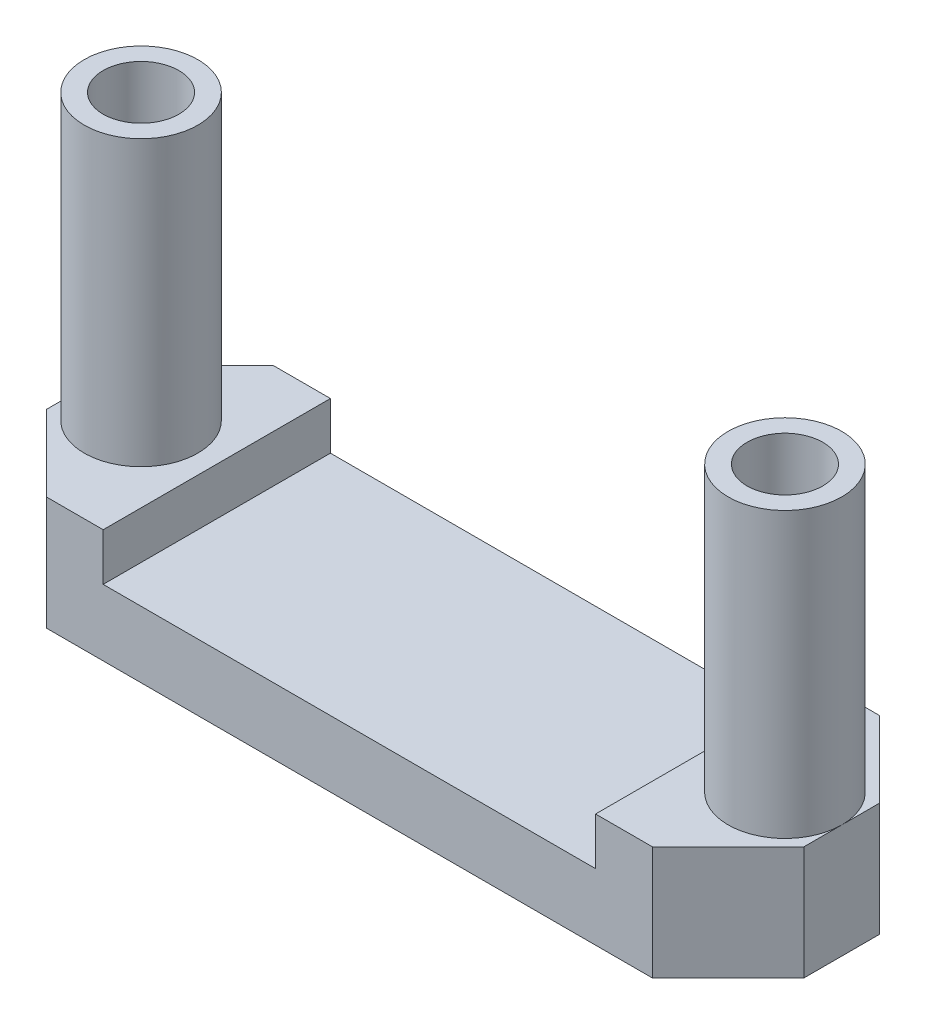
ISO-10303-21;
HEADER;
FILE_DESCRIPTION(('STEP AP214'),'2;1');
FILE_NAME('part.step','',(''),(''),'','','');
FILE_SCHEMA(('AUTOMOTIVE_DESIGN { 1 0 10303 214 1 1 1 1 }'));
ENDSEC;
DATA;
#1=APPLICATION_CONTEXT('core data for automotive mechanical design processes');
#2=APPLICATION_PROTOCOL_DEFINITION('international standard','automotive_design',2000,#1);
#3=PRODUCT_CONTEXT('',#1,'mechanical');
#4=PRODUCT('Part','Part','',(#3));
#5=PRODUCT_RELATED_PRODUCT_CATEGORY('part','',(#4));
#6=PRODUCT_DEFINITION_FORMATION('','',#4);
#7=PRODUCT_DEFINITION_CONTEXT('part definition',#1,'design');
#8=PRODUCT_DEFINITION('design','',#6,#7);
#9=PRODUCT_DEFINITION_SHAPE('','',#8);
#10=(LENGTH_UNIT() NAMED_UNIT(*) SI_UNIT(.MILLI.,.METRE.));
#11=(NAMED_UNIT(*) PLANE_ANGLE_UNIT() SI_UNIT($,.RADIAN.));
#12=(NAMED_UNIT(*) SI_UNIT($,.STERADIAN.) SOLID_ANGLE_UNIT());
#13=UNCERTAINTY_MEASURE_WITH_UNIT(LENGTH_MEASURE(1.E-05),#10,'distance_accuracy_value','');
#14=(GEOMETRIC_REPRESENTATION_CONTEXT(3) GLOBAL_UNCERTAINTY_ASSIGNED_CONTEXT((#13)) GLOBAL_UNIT_ASSIGNED_CONTEXT((#10,
#11,#12)) REPRESENTATION_CONTEXT('',''));
#15=CARTESIAN_POINT('',(0.,0.,0.));
#16=DIRECTION('',(0.,0.,1.));
#17=DIRECTION('',(1.,0.,0.));
#18=AXIS2_PLACEMENT_3D('',#15,#16,#17);
#19=CARTESIAN_POINT('',(0.,3.,0.));
#20=DIRECTION('',(0.,-1.,0.));
#21=DIRECTION('',(0.,0.,-1.));
#22=AXIS2_PLACEMENT_3D('',#19,#20,#21);
#23=PLANE('',#22);
#24=DIRECTION('',(0.,0.,1.));
#25=VECTOR('',#24,1.);
#26=CARTESIAN_POINT('',(-9.99999999999999,3.,3.));
#27=LINE('',#26,#25);
#28=CARTESIAN_POINT('',(-9.99999999999999,3.,-1.));
#29=VERTEX_POINT('',#28);
#30=CARTESIAN_POINT('',(-9.99999999999999,3.,0.));
#31=VERTEX_POINT('',#30);
#32=EDGE_CURVE('E139',#29,#31,#27,.T.);
#33=ORIENTED_EDGE('',*,*,#32,.T.);
#34=CARTESIAN_POINT('',(-8.49999999999999,3.,0.));
#35=DIRECTION('',(0.,1.,0.));
#36=DIRECTION('',(0.,0.,1.));
#37=AXIS2_PLACEMENT_3D('',#34,#35,#36);
#38=CIRCLE('',#37,1.5);
#39=EDGE_CURVE('E141',#31,#31,#38,.T.);
#40=ORIENTED_EDGE('',*,*,#39,.F.);
#41=CARTESIAN_POINT('',(-9.99999999999999,3.,0.999999999999991));
#42=VERTEX_POINT('',#41);
#43=EDGE_CURVE('E67',#31,#42,#27,.T.);
#44=ORIENTED_EDGE('',*,*,#43,.T.);
#45=DIRECTION('',(-0.707106781186546,0.,-0.707106781186549));
#46=VECTOR('',#45,1.);
#47=CARTESIAN_POINT('',(-7.99999999999999,3.,3.));
#48=LINE('',#47,#46);
#49=CARTESIAN_POINT('',(-7.99999999999999,3.,3.));
#50=VERTEX_POINT('',#49);
#51=EDGE_CURVE('E55',#42,#50,#48,.F.);
#52=ORIENTED_EDGE('',*,*,#51,.T.);
#53=DIRECTION('',(1.,0.,0.));
#54=VECTOR('',#53,1.);
#55=CARTESIAN_POINT('',(-9.99999999999999,3.,3.));
#56=LINE('',#55,#54);
#57=CARTESIAN_POINT('',(-6.5,3.,3.));
#58=VERTEX_POINT('',#57);
#59=EDGE_CURVE('E162',#50,#58,#56,.T.);
#60=ORIENTED_EDGE('',*,*,#59,.T.);
#61=DIRECTION('',(0.,0.,1.));
#62=VECTOR('',#61,1.);
#63=CARTESIAN_POINT('',(-6.5,3.,3.));
#64=LINE('',#63,#62);
#65=CARTESIAN_POINT('',(-6.5,3.,-3.));
#66=VERTEX_POINT('',#65);
#67=EDGE_CURVE('E280',#66,#58,#64,.T.);
#68=ORIENTED_EDGE('',*,*,#67,.F.);
#69=DIRECTION('',(-1.,0.,0.));
#70=VECTOR('',#69,1.);
#71=CARTESIAN_POINT('',(-9.99999999999999,3.,-3.));
#72=LINE('',#71,#70);
#73=CARTESIAN_POINT('',(-7.99999999999999,3.,-3.));
#74=VERTEX_POINT('',#73);
#75=EDGE_CURVE('E158',#66,#74,#72,.T.);
#76=ORIENTED_EDGE('',*,*,#75,.T.);
#77=DIRECTION('',(0.707106781186549,0.,-0.707106781186546));
#78=VECTOR('',#77,1.);
#79=CARTESIAN_POINT('',(-9.99999999999999,3.,-1.));
#80=LINE('',#79,#78);
#81=EDGE_CURVE('E11',#74,#29,#80,.F.);
#82=ORIENTED_EDGE('',*,*,#81,.T.);
#83=EDGE_LOOP('',(#33,#40,#44,#52,#60,#68,#76,#82));
#84=FACE_BOUND('',#83,.T.);
#85=ADVANCED_FACE('F45',(#84),#23,.F.);
#86=DIRECTION('',(0.,0.,-1.));
#87=VECTOR('',#86,1.);
#88=CARTESIAN_POINT('',(10.,3.,3.));
#89=LINE('',#88,#87);
#90=CARTESIAN_POINT('',(10.,3.,1.));
#91=VERTEX_POINT('',#90);
#92=CARTESIAN_POINT('',(10.,3.,0.));
#93=VERTEX_POINT('',#92);
#94=EDGE_CURVE('E264',#91,#93,#89,.T.);
#95=ORIENTED_EDGE('',*,*,#94,.T.);
#96=CARTESIAN_POINT('',(8.49999999999999,3.,0.));
#97=DIRECTION('',(0.,-1.,0.));
#98=DIRECTION('',(0.,0.,1.));
#99=AXIS2_PLACEMENT_3D('',#96,#97,#98);
#100=CIRCLE('',#99,1.5);
#101=EDGE_CURVE('E60',#93,#93,#100,.T.);
#102=ORIENTED_EDGE('',*,*,#101,.T.);
#103=CARTESIAN_POINT('',(10.,3.,-0.999999999999995));
#104=VERTEX_POINT('',#103);
#105=EDGE_CURVE('E182',#93,#104,#89,.T.);
#106=ORIENTED_EDGE('',*,*,#105,.T.);
#107=DIRECTION('',(0.707106781186546,0.,0.707106781186549));
#108=VECTOR('',#107,1.);
#109=CARTESIAN_POINT('',(8.00000000000001,3.,-3.));
#110=LINE('',#109,#108);
#111=CARTESIAN_POINT('',(8.00000000000001,3.,-3.));
#112=VERTEX_POINT('',#111);
#113=EDGE_CURVE('E212',#104,#112,#110,.F.);
#114=ORIENTED_EDGE('',*,*,#113,.T.);
#115=CARTESIAN_POINT('',(6.5,3.,-3.));
#116=VERTEX_POINT('',#115);
#117=EDGE_CURVE('E156',#112,#116,#72,.T.);
#118=ORIENTED_EDGE('',*,*,#117,.T.);
#119=DIRECTION('',(0.,0.,-1.));
#120=VECTOR('',#119,1.);
#121=CARTESIAN_POINT('',(6.5,3.,3.));
#122=LINE('',#121,#120);
#123=CARTESIAN_POINT('',(6.5,3.,3.));
#124=VERTEX_POINT('',#123);
#125=EDGE_CURVE('E276',#124,#116,#122,.T.);
#126=ORIENTED_EDGE('',*,*,#125,.F.);
#127=CARTESIAN_POINT('',(8.,3.,3.));
#128=VERTEX_POINT('',#127);
#129=EDGE_CURVE('E148',#124,#128,#56,.T.);
#130=ORIENTED_EDGE('',*,*,#129,.T.);
#131=DIRECTION('',(-0.707106781186549,0.,0.707106781186546));
#132=VECTOR('',#131,1.);
#133=CARTESIAN_POINT('',(10.,3.,1.));
#134=LINE('',#133,#132);
#135=EDGE_CURVE('E209',#128,#91,#134,.F.);
#136=ORIENTED_EDGE('',*,*,#135,.T.);
#137=EDGE_LOOP('',(#95,#102,#106,#114,#118,#126,#130,#136));
#138=FACE_BOUND('',#137,.T.);
#139=ADVANCED_FACE('F274',(#138),#23,.F.);
#140=CARTESIAN_POINT('',(0.,0.,0.));
#141=DIRECTION('',(0.,-1.,0.));
#142=DIRECTION('',(0.,0.,-1.));
#143=AXIS2_PLACEMENT_3D('',#140,#141,#142);
#144=PLANE('',#143);
#145=CARTESIAN_POINT('',(-8.49999999999999,0.,0.));
#146=DIRECTION('',(0.,1.,0.));
#147=DIRECTION('',(0.,0.,1.));
#148=AXIS2_PLACEMENT_3D('',#145,#146,#147);
#149=CIRCLE('',#148,1.);
#150=CARTESIAN_POINT('',(-8.49999999999999,0.,1.));
#151=VERTEX_POINT('',#150);
#152=EDGE_CURVE('E171',#151,#151,#149,.T.);
#153=ORIENTED_EDGE('',*,*,#152,.T.);
#154=EDGE_LOOP('',(#153));
#155=FACE_BOUND('',#154,.T.);
#156=DIRECTION('',(-1.,0.,0.));
#157=VECTOR('',#156,1.);
#158=CARTESIAN_POINT('',(-9.99999999999999,0.,-3.));
#159=LINE('',#158,#157);
#160=CARTESIAN_POINT('',(8.00000000000001,0.,-3.));
#161=VERTEX_POINT('',#160);
#162=CARTESIAN_POINT('',(-7.99999999999999,0.,-3.));
#163=VERTEX_POINT('',#162);
#164=EDGE_CURVE('E170',#161,#163,#159,.T.);
#165=ORIENTED_EDGE('',*,*,#164,.F.);
#166=DIRECTION('',(-0.707106781186546,0.,-0.707106781186549));
#167=VECTOR('',#166,1.);
#168=CARTESIAN_POINT('',(5.50000000000002,0.,-5.5));
#169=LINE('',#168,#167);
#170=CARTESIAN_POINT('',(10.,0.,-0.999999999999995));
#171=VERTEX_POINT('',#170);
#172=EDGE_CURVE('E198',#161,#171,#169,.F.);
#173=ORIENTED_EDGE('',*,*,#172,.T.);
#174=DIRECTION('',(0.,0.,-1.));
#175=VECTOR('',#174,1.);
#176=CARTESIAN_POINT('',(10.,0.,3.));
#177=LINE('',#176,#175);
#178=CARTESIAN_POINT('',(10.,0.,1.));
#179=VERTEX_POINT('',#178);
#180=EDGE_CURVE('E166',#179,#171,#177,.T.);
#181=ORIENTED_EDGE('',*,*,#180,.F.);
#182=DIRECTION('',(0.707106781186549,0.,-0.707106781186546));
#183=VECTOR('',#182,1.);
#184=CARTESIAN_POINT('',(5.49999999999999,0.,5.50000000000001));
#185=LINE('',#184,#183);
#186=CARTESIAN_POINT('',(8.,0.,3.));
#187=VERTEX_POINT('',#186);
#188=EDGE_CURVE('E195',#179,#187,#185,.F.);
#189=ORIENTED_EDGE('',*,*,#188,.T.);
#190=DIRECTION('',(1.,0.,0.));
#191=VECTOR('',#190,1.);
#192=CARTESIAN_POINT('',(-9.99999999999999,0.,3.));
#193=LINE('',#192,#191);
#194=CARTESIAN_POINT('',(-7.99999999999999,0.,3.));
#195=VERTEX_POINT('',#194);
#196=EDGE_CURVE('E178',#195,#187,#193,.T.);
#197=ORIENTED_EDGE('',*,*,#196,.F.);
#198=DIRECTION('',(0.707106781186546,0.,0.707106781186549));
#199=VECTOR('',#198,1.);
#200=CARTESIAN_POINT('',(-5.50000000000001,0.,5.49999999999999));
#201=LINE('',#200,#199);
#202=CARTESIAN_POINT('',(-9.99999999999999,0.,0.999999999999991));
#203=VERTEX_POINT('',#202);
#204=EDGE_CURVE('E189',#195,#203,#201,.F.);
#205=ORIENTED_EDGE('',*,*,#204,.T.);
#206=DIRECTION('',(0.,0.,1.));
#207=VECTOR('',#206,1.);
#208=CARTESIAN_POINT('',(-9.99999999999999,0.,3.));
#209=LINE('',#208,#207);
#210=CARTESIAN_POINT('',(-9.99999999999999,0.,-1.));
#211=VERTEX_POINT('',#210);
#212=EDGE_CURVE('E175',#211,#203,#209,.T.);
#213=ORIENTED_EDGE('',*,*,#212,.F.);
#214=DIRECTION('',(-0.707106781186549,0.,0.707106781186546));
#215=VECTOR('',#214,1.);
#216=CARTESIAN_POINT('',(-5.49999999999998,0.,-5.5));
#217=LINE('',#216,#215);
#218=EDGE_CURVE('E192',#211,#163,#217,.F.);
#219=ORIENTED_EDGE('',*,*,#218,.T.);
#220=EDGE_LOOP('',(#165,#173,#181,#189,#197,#205,#213,#219));
#221=FACE_BOUND('',#220,.T.);
#222=CARTESIAN_POINT('',(8.49999999999999,0.,0.));
#223=DIRECTION('',(0.,1.,0.));
#224=DIRECTION('',(0.,0.,-1.));
#225=AXIS2_PLACEMENT_3D('',#222,#223,#224);
#226=CIRCLE('',#225,1.);
#227=CARTESIAN_POINT('',(8.49999999999999,0.,-1.));
#228=VERTEX_POINT('',#227);
#229=EDGE_CURVE('E296',#228,#228,#226,.T.);
#230=ORIENTED_EDGE('',*,*,#229,.T.);
#231=EDGE_LOOP('',(#230));
#232=FACE_BOUND('',#231,.T.);
#233=ADVANCED_FACE('F242',(#155,#221,#232),#144,.T.);
#234=CARTESIAN_POINT('',(10.,3.,3.));
#235=DIRECTION('',(-1.,0.,0.));
#236=DIRECTION('',(0.,0.,1.));
#237=AXIS2_PLACEMENT_3D('',#234,#235,#236);
#238=PLANE('',#237);
#239=ORIENTED_EDGE('',*,*,#180,.T.);
#240=DIRECTION('',(0.,1.,0.));
#241=VECTOR('',#240,1.);
#242=CARTESIAN_POINT('',(10.,3.,-0.999999999999995));
#243=LINE('',#242,#241);
#244=EDGE_CURVE('E205',#171,#104,#243,.T.);
#245=ORIENTED_EDGE('',*,*,#244,.T.);
#246=ORIENTED_EDGE('',*,*,#105,.F.);
#247=ORIENTED_EDGE('',*,*,#94,.F.);
#248=DIRECTION('',(0.,-1.,0.));
#249=VECTOR('',#248,1.);
#250=CARTESIAN_POINT('',(10.,3.,1.));
#251=LINE('',#250,#249);
#252=EDGE_CURVE('E201',#91,#179,#251,.T.);
#253=ORIENTED_EDGE('',*,*,#252,.T.);
#254=EDGE_LOOP('',(#239,#245,#246,#247,#253));
#255=FACE_BOUND('',#254,.T.);
#256=ADVANCED_FACE('F259',(#255),#238,.F.);
#257=CARTESIAN_POINT('',(-9.99999999999999,3.,-3.));
#258=DIRECTION('',(0.,0.,1.));
#259=DIRECTION('',(1.,0.,0.));
#260=AXIS2_PLACEMENT_3D('',#257,#258,#259);
#261=PLANE('',#260);
#262=ORIENTED_EDGE('',*,*,#117,.F.);
#263=DIRECTION('',(0.,-1.,0.));
#264=VECTOR('',#263,1.);
#265=CARTESIAN_POINT('',(8.00000000000001,3.,-3.));
#266=LINE('',#265,#264);
#267=EDGE_CURVE('E185',#112,#161,#266,.T.);
#268=ORIENTED_EDGE('',*,*,#267,.T.);
#269=ORIENTED_EDGE('',*,*,#164,.T.);
#270=DIRECTION('',(0.,1.,0.));
#271=VECTOR('',#270,1.);
#272=CARTESIAN_POINT('',(-7.99999999999999,3.,-3.));
#273=LINE('',#272,#271);
#274=EDGE_CURVE('E165',#163,#74,#273,.T.);
#275=ORIENTED_EDGE('',*,*,#274,.T.);
#276=ORIENTED_EDGE('',*,*,#75,.F.);
#277=DIRECTION('',(0.,1.,0.));
#278=VECTOR('',#277,1.);
#279=CARTESIAN_POINT('',(-6.5,1.75,-3.));
#280=LINE('',#279,#278);
#281=CARTESIAN_POINT('',(-6.5,1.75,-3.));
#282=VERTEX_POINT('',#281);
#283=EDGE_CURVE('E299',#282,#66,#280,.T.);
#284=ORIENTED_EDGE('',*,*,#283,.F.);
#285=DIRECTION('',(-1.,0.,0.));
#286=VECTOR('',#285,1.);
#287=CARTESIAN_POINT('',(-6.5,1.75,-3.));
#288=LINE('',#287,#286);
#289=CARTESIAN_POINT('',(6.5,1.75,-3.));
#290=VERTEX_POINT('',#289);
#291=EDGE_CURVE('E333',#290,#282,#288,.T.);
#292=ORIENTED_EDGE('',*,*,#291,.F.);
#293=DIRECTION('',(0.,1.,0.));
#294=VECTOR('',#293,1.);
#295=CARTESIAN_POINT('',(6.5,1.75,-3.));
#296=LINE('',#295,#294);
#297=EDGE_CURVE('E302',#290,#116,#296,.T.);
#298=ORIENTED_EDGE('',*,*,#297,.T.);
#299=EDGE_LOOP('',(#262,#268,#269,#275,#276,#284,#292,#298));
#300=FACE_BOUND('',#299,.T.);
#301=ADVANCED_FACE('F249',(#300),#261,.F.);
#302=CARTESIAN_POINT('',(-9.99999999999999,3.,3.));
#303=DIRECTION('',(1.,0.,0.));
#304=DIRECTION('',(0.,0.,-1.));
#305=AXIS2_PLACEMENT_3D('',#302,#303,#304);
#306=PLANE('',#305);
#307=ORIENTED_EDGE('',*,*,#32,.F.);
#308=DIRECTION('',(0.,-1.,0.));
#309=VECTOR('',#308,1.);
#310=CARTESIAN_POINT('',(-9.99999999999999,3.,-1.));
#311=LINE('',#310,#309);
#312=EDGE_CURVE('E224',#29,#211,#311,.T.);
#313=ORIENTED_EDGE('',*,*,#312,.T.);
#314=ORIENTED_EDGE('',*,*,#212,.T.);
#315=DIRECTION('',(0.,1.,0.));
#316=VECTOR('',#315,1.);
#317=CARTESIAN_POINT('',(-9.99999999999999,3.,0.999999999999991));
#318=LINE('',#317,#316);
#319=EDGE_CURVE('E153',#203,#42,#318,.T.);
#320=ORIENTED_EDGE('',*,*,#319,.T.);
#321=ORIENTED_EDGE('',*,*,#43,.F.);
#322=EDGE_LOOP('',(#307,#313,#314,#320,#321));
#323=FACE_BOUND('',#322,.T.);
#324=ADVANCED_FACE('F150',(#323),#306,.F.);
#325=CARTESIAN_POINT('',(-9.99999999999999,3.,3.));
#326=DIRECTION('',(0.,0.,-1.));
#327=DIRECTION('',(-1.,0.,0.));
#328=AXIS2_PLACEMENT_3D('',#325,#326,#327);
#329=PLANE('',#328);
#330=ORIENTED_EDGE('',*,*,#196,.T.);
#331=DIRECTION('',(0.,1.,0.));
#332=VECTOR('',#331,1.);
#333=CARTESIAN_POINT('',(8.,3.,3.));
#334=LINE('',#333,#332);
#335=EDGE_CURVE('E219',#187,#128,#334,.T.);
#336=ORIENTED_EDGE('',*,*,#335,.T.);
#337=ORIENTED_EDGE('',*,*,#129,.F.);
#338=DIRECTION('',(0.,1.,0.));
#339=VECTOR('',#338,1.);
#340=CARTESIAN_POINT('',(6.5,1.75,3.));
#341=LINE('',#340,#339);
#342=CARTESIAN_POINT('',(6.5,1.75,3.));
#343=VERTEX_POINT('',#342);
#344=EDGE_CURVE('E293',#343,#124,#341,.T.);
#345=ORIENTED_EDGE('',*,*,#344,.F.);
#346=DIRECTION('',(1.,0.,0.));
#347=VECTOR('',#346,1.);
#348=CARTESIAN_POINT('',(-6.5,1.75,3.));
#349=LINE('',#348,#347);
#350=CARTESIAN_POINT('',(-6.5,1.75,3.));
#351=VERTEX_POINT('',#350);
#352=EDGE_CURVE('E290',#351,#343,#349,.T.);
#353=ORIENTED_EDGE('',*,*,#352,.F.);
#354=DIRECTION('',(0.,1.,0.));
#355=VECTOR('',#354,1.);
#356=CARTESIAN_POINT('',(-6.5,1.75,3.));
#357=LINE('',#356,#355);
#358=EDGE_CURVE('E238',#351,#58,#357,.T.);
#359=ORIENTED_EDGE('',*,*,#358,.T.);
#360=ORIENTED_EDGE('',*,*,#59,.F.);
#361=DIRECTION('',(0.,-1.,0.));
#362=VECTOR('',#361,1.);
#363=CARTESIAN_POINT('',(-7.99999999999999,3.,3.));
#364=LINE('',#363,#362);
#365=EDGE_CURVE('E215',#50,#195,#364,.T.);
#366=ORIENTED_EDGE('',*,*,#365,.T.);
#367=EDGE_LOOP('',(#330,#336,#337,#345,#353,#359,#360,#366));
#368=FACE_BOUND('',#367,.T.);
#369=ADVANCED_FACE('F234',(#368),#329,.F.);
#370=CARTESIAN_POINT('',(-8.49999999999999,3.,0.));
#371=DIRECTION('',(0.,-1.,0.));
#372=DIRECTION('',(0.,0.,-1.));
#373=AXIS2_PLACEMENT_3D('',#370,#371,#372);
#374=CYLINDRICAL_SURFACE('',#373,1.);
#375=ORIENTED_EDGE('',*,*,#152,.F.);
#376=EDGE_LOOP('',(#375));
#377=FACE_BOUND('',#376,.T.);
#378=CARTESIAN_POINT('',(-8.49999999999999,10.5,0.));
#379=DIRECTION('',(0.,1.,0.));
#380=DIRECTION('',(0.,0.,1.));
#381=AXIS2_PLACEMENT_3D('',#378,#379,#380);
#382=CIRCLE('',#381,1.);
#383=CARTESIAN_POINT('',(-8.49999999999999,10.5,1.));
#384=VERTEX_POINT('',#383);
#385=EDGE_CURVE('E320',#384,#384,#382,.T.);
#386=ORIENTED_EDGE('',*,*,#385,.T.);
#387=EDGE_LOOP('',(#386));
#388=FACE_BOUND('',#387,.T.);
#389=ADVANCED_FACE('F363',(#377,#388),#374,.F.);
#390=CARTESIAN_POINT('',(8.49999999999999,3.,0.));
#391=DIRECTION('',(0.,-1.,0.));
#392=DIRECTION('',(0.,0.,-1.));
#393=AXIS2_PLACEMENT_3D('',#390,#391,#392);
#394=CYLINDRICAL_SURFACE('',#393,1.);
#395=ORIENTED_EDGE('',*,*,#229,.F.);
#396=EDGE_LOOP('',(#395));
#397=FACE_BOUND('',#396,.T.);
#398=CARTESIAN_POINT('',(8.49999999999999,10.5,0.));
#399=DIRECTION('',(0.,-1.,0.));
#400=DIRECTION('',(0.,0.,1.));
#401=AXIS2_PLACEMENT_3D('',#398,#399,#400);
#402=CIRCLE('',#401,1.);
#403=CARTESIAN_POINT('',(8.49999999999999,10.5,1.));
#404=VERTEX_POINT('',#403);
#405=EDGE_CURVE('E315',#404,#404,#402,.T.);
#406=ORIENTED_EDGE('',*,*,#405,.F.);
#407=EDGE_LOOP('',(#406));
#408=FACE_BOUND('',#407,.T.);
#409=ADVANCED_FACE('F354',(#397,#408),#394,.F.);
#410=CARTESIAN_POINT('',(6.5,1.75,3.));
#411=DIRECTION('',(1.,0.,0.));
#412=DIRECTION('',(0.,0.,-1.));
#413=AXIS2_PLACEMENT_3D('',#410,#411,#412);
#414=PLANE('',#413);
#415=ORIENTED_EDGE('',*,*,#125,.T.);
#416=ORIENTED_EDGE('',*,*,#297,.F.);
#417=DIRECTION('',(0.,0.,-1.));
#418=VECTOR('',#417,1.);
#419=CARTESIAN_POINT('',(6.5,1.75,3.));
#420=LINE('',#419,#418);
#421=EDGE_CURVE('E285',#343,#290,#420,.T.);
#422=ORIENTED_EDGE('',*,*,#421,.F.);
#423=ORIENTED_EDGE('',*,*,#344,.T.);
#424=EDGE_LOOP('',(#415,#416,#422,#423));
#425=FACE_BOUND('',#424,.T.);
#426=ADVANCED_FACE('F343',(#425),#414,.F.);
#427=CARTESIAN_POINT('',(-6.5,1.75,3.));
#428=DIRECTION('',(-1.,0.,0.));
#429=DIRECTION('',(0.,0.,1.));
#430=AXIS2_PLACEMENT_3D('',#427,#428,#429);
#431=PLANE('',#430);
#432=ORIENTED_EDGE('',*,*,#67,.T.);
#433=ORIENTED_EDGE('',*,*,#358,.F.);
#434=DIRECTION('',(0.,0.,1.));
#435=VECTOR('',#434,1.);
#436=CARTESIAN_POINT('',(-6.5,1.75,3.));
#437=LINE('',#436,#435);
#438=EDGE_CURVE('E336',#282,#351,#437,.T.);
#439=ORIENTED_EDGE('',*,*,#438,.F.);
#440=ORIENTED_EDGE('',*,*,#283,.T.);
#441=EDGE_LOOP('',(#432,#433,#439,#440));
#442=FACE_BOUND('',#441,.T.);
#443=ADVANCED_FACE('F346',(#442),#431,.F.);
#444=CARTESIAN_POINT('',(0.,1.75,0.));
#445=DIRECTION('',(0.,-1.,0.));
#446=DIRECTION('',(0.,0.,-1.));
#447=AXIS2_PLACEMENT_3D('',#444,#445,#446);
#448=PLANE('',#447);
#449=ORIENTED_EDGE('',*,*,#421,.T.);
#450=ORIENTED_EDGE('',*,*,#291,.T.);
#451=ORIENTED_EDGE('',*,*,#438,.T.);
#452=ORIENTED_EDGE('',*,*,#352,.T.);
#453=EDGE_LOOP('',(#449,#450,#451,#452));
#454=FACE_BOUND('',#453,.T.);
#455=ADVANCED_FACE('F341',(#454),#448,.F.);
#456=CARTESIAN_POINT('',(8.00000000000001,3.,-3.));
#457=DIRECTION('',(-0.707106781186549,0.,0.707106781186546));
#458=DIRECTION('',(0.,-1.,0.));
#459=AXIS2_PLACEMENT_3D('',#456,#457,#458);
#460=PLANE('',#459);
#461=ORIENTED_EDGE('',*,*,#113,.F.);
#462=ORIENTED_EDGE('',*,*,#244,.F.);
#463=ORIENTED_EDGE('',*,*,#172,.F.);
#464=ORIENTED_EDGE('',*,*,#267,.F.);
#465=EDGE_LOOP('',(#461,#462,#463,#464));
#466=FACE_BOUND('',#465,.T.);
#467=ADVANCED_FACE('F255',(#466),#460,.F.);
#468=CARTESIAN_POINT('',(10.,3.,1.));
#469=DIRECTION('',(-0.707106781186546,0.,-0.707106781186549));
#470=DIRECTION('',(0.,-1.,0.));
#471=AXIS2_PLACEMENT_3D('',#468,#469,#470);
#472=PLANE('',#471);
#473=ORIENTED_EDGE('',*,*,#135,.F.);
#474=ORIENTED_EDGE('',*,*,#335,.F.);
#475=ORIENTED_EDGE('',*,*,#188,.F.);
#476=ORIENTED_EDGE('',*,*,#252,.F.);
#477=EDGE_LOOP('',(#473,#474,#475,#476));
#478=FACE_BOUND('',#477,.T.);
#479=ADVANCED_FACE('F267',(#478),#472,.F.);
#480=CARTESIAN_POINT('',(-9.99999999999999,3.,-1.));
#481=DIRECTION('',(0.707106781186546,0.,0.707106781186549));
#482=DIRECTION('',(0.,-1.,0.));
#483=AXIS2_PLACEMENT_3D('',#480,#481,#482);
#484=PLANE('',#483);
#485=ORIENTED_EDGE('',*,*,#81,.F.);
#486=ORIENTED_EDGE('',*,*,#274,.F.);
#487=ORIENTED_EDGE('',*,*,#218,.F.);
#488=ORIENTED_EDGE('',*,*,#312,.F.);
#489=EDGE_LOOP('',(#485,#486,#487,#488));
#490=FACE_BOUND('',#489,.T.);
#491=ADVANCED_FACE('F245',(#490),#484,.F.);
#492=CARTESIAN_POINT('',(-7.99999999999999,3.,3.));
#493=DIRECTION('',(0.707106781186549,0.,-0.707106781186546));
#494=DIRECTION('',(0.,-1.,0.));
#495=AXIS2_PLACEMENT_3D('',#492,#493,#494);
#496=PLANE('',#495);
#497=ORIENTED_EDGE('',*,*,#51,.F.);
#498=ORIENTED_EDGE('',*,*,#319,.F.);
#499=ORIENTED_EDGE('',*,*,#204,.F.);
#500=ORIENTED_EDGE('',*,*,#365,.F.);
#501=EDGE_LOOP('',(#497,#498,#499,#500));
#502=FACE_BOUND('',#501,.T.);
#503=ADVANCED_FACE('F48',(#502),#496,.F.);
#504=CARTESIAN_POINT('',(-8.49999999999999,10.5,0.));
#505=DIRECTION('',(0.,1.,0.));
#506=DIRECTION('',(0.,0.,1.));
#507=AXIS2_PLACEMENT_3D('',#504,#505,#506);
#508=PLANE('',#507);
#509=CARTESIAN_POINT('',(-8.49999999999999,10.5,0.));
#510=DIRECTION('',(0.,1.,0.));
#511=DIRECTION('',(0.,0.,1.));
#512=AXIS2_PLACEMENT_3D('',#509,#510,#511);
#513=CIRCLE('',#512,1.5);
#514=CARTESIAN_POINT('',(-8.49999999999999,10.5,1.5));
#515=VERTEX_POINT('',#514);
#516=EDGE_CURVE('E281',#515,#515,#513,.T.);
#517=ORIENTED_EDGE('',*,*,#516,.T.);
#518=EDGE_LOOP('',(#517));
#519=FACE_BOUND('',#518,.T.);
#520=ORIENTED_EDGE('',*,*,#385,.F.);
#521=EDGE_LOOP('',(#520));
#522=FACE_BOUND('',#521,.T.);
#523=ADVANCED_FACE('F392',(#519,#522),#508,.T.);
#524=CARTESIAN_POINT('',(-8.49999999999999,10.5,0.));
#525=DIRECTION('',(0.,-1.,0.));
#526=DIRECTION('',(0.,0.,-1.));
#527=AXIS2_PLACEMENT_3D('',#524,#525,#526);
#528=CYLINDRICAL_SURFACE('',#527,1.5);
#529=ORIENTED_EDGE('',*,*,#516,.F.);
#530=EDGE_LOOP('',(#529));
#531=FACE_BOUND('',#530,.T.);
#532=ORIENTED_EDGE('',*,*,#39,.T.);
#533=EDGE_LOOP('',(#532));
#534=FACE_BOUND('',#533,.T.);
#535=ADVANCED_FACE('F396',(#531,#534),#528,.T.);
#536=CARTESIAN_POINT('',(8.49999999999999,10.5,0.));
#537=DIRECTION('',(0.,-1.,0.));
#538=DIRECTION('',(0.,0.,-1.));
#539=AXIS2_PLACEMENT_3D('',#536,#537,#538);
#540=CYLINDRICAL_SURFACE('',#539,1.5);
#541=CARTESIAN_POINT('',(8.49999999999999,10.5,0.));
#542=DIRECTION('',(0.,-1.,0.));
#543=DIRECTION('',(0.,0.,1.));
#544=AXIS2_PLACEMENT_3D('',#541,#542,#543);
#545=CIRCLE('',#544,1.5);
#546=CARTESIAN_POINT('',(8.49999999999999,10.5,1.5));
#547=VERTEX_POINT('',#546);
#548=EDGE_CURVE('E314',#547,#547,#545,.T.);
#549=ORIENTED_EDGE('',*,*,#548,.T.);
#550=EDGE_LOOP('',(#549));
#551=FACE_BOUND('',#550,.T.);
#552=ORIENTED_EDGE('',*,*,#101,.F.);
#553=EDGE_LOOP('',(#552));
#554=FACE_BOUND('',#553,.T.);
#555=ADVANCED_FACE('F402',(#551,#554),#540,.T.);
#556=CARTESIAN_POINT('',(8.49999999999999,10.5,0.));
#557=DIRECTION('',(0.,1.,0.));
#558=DIRECTION('',(0.,0.,1.));
#559=AXIS2_PLACEMENT_3D('',#556,#557,#558);
#560=PLANE('',#559);
#561=ORIENTED_EDGE('',*,*,#405,.T.);
#562=EDGE_LOOP('',(#561));
#563=FACE_BOUND('',#562,.T.);
#564=ORIENTED_EDGE('',*,*,#548,.F.);
#565=EDGE_LOOP('',(#564));
#566=FACE_BOUND('',#565,.T.);
#567=ADVANCED_FACE('F409',(#563,#566),#560,.T.);
#568=CLOSED_SHELL('',(#85,#139,#233,#256,#301,#324,#369,#389,#409,#426,#443,#455,#467,#479,#491,
#503,#523,#535,#555,#567));
#569=MANIFOLD_SOLID_BREP('B2',#568);
#570=ADVANCED_BREP_SHAPE_REPRESENTATION('',(#18,#569),#14);
#571=SHAPE_DEFINITION_REPRESENTATION(#9,#570);
ENDSEC;
END-ISO-10303-21;
